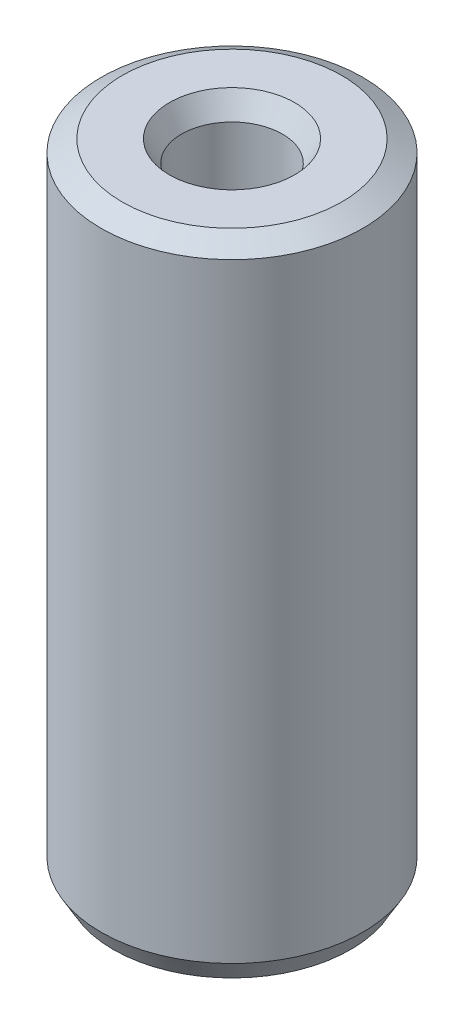
ISO-10303-21;
HEADER;
FILE_DESCRIPTION(('STEP AP214'),'2;1');
FILE_NAME('part.step','',(''),(''),'','','');
FILE_SCHEMA(('AUTOMOTIVE_DESIGN { 1 0 10303 214 1 1 1 1 }'));
ENDSEC;
DATA;
#1=APPLICATION_CONTEXT('core data for automotive mechanical design processes');
#2=APPLICATION_PROTOCOL_DEFINITION('international standard','automotive_design',2000,#1);
#3=PRODUCT_CONTEXT('',#1,'mechanical');
#4=PRODUCT('Part','Part','',(#3));
#5=PRODUCT_RELATED_PRODUCT_CATEGORY('part','',(#4));
#6=PRODUCT_DEFINITION_FORMATION('','',#4);
#7=PRODUCT_DEFINITION_CONTEXT('part definition',#1,'design');
#8=PRODUCT_DEFINITION('design','',#6,#7);
#9=PRODUCT_DEFINITION_SHAPE('','',#8);
#10=(LENGTH_UNIT() NAMED_UNIT(*) SI_UNIT(.MILLI.,.METRE.));
#11=(NAMED_UNIT(*) PLANE_ANGLE_UNIT() SI_UNIT($,.RADIAN.));
#12=(NAMED_UNIT(*) SI_UNIT($,.STERADIAN.) SOLID_ANGLE_UNIT());
#13=UNCERTAINTY_MEASURE_WITH_UNIT(LENGTH_MEASURE(1.E-05),#10,'distance_accuracy_value','');
#14=(GEOMETRIC_REPRESENTATION_CONTEXT(3) GLOBAL_UNCERTAINTY_ASSIGNED_CONTEXT((#13)) GLOBAL_UNIT_ASSIGNED_CONTEXT((#10,
#11,#12)) REPRESENTATION_CONTEXT('',''));
#15=CARTESIAN_POINT('',(0.,0.,0.));
#16=DIRECTION('',(0.,0.,1.));
#17=DIRECTION('',(1.,0.,0.));
#18=AXIS2_PLACEMENT_3D('',#15,#16,#17);
#19=CARTESIAN_POINT('',(0.,159.666058399962,0.));
#20=DIRECTION('',(0.,-1.,0.));
#21=DIRECTION('',(0.,0.,-1.));
#22=AXIS2_PLACEMENT_3D('',#19,#20,#21);
#23=CYLINDRICAL_SURFACE('',#22,32.5);
#24=CARTESIAN_POINT('',(0.,5.25552621330533,0.));
#25=DIRECTION('',(0.,1.,0.));
#26=DIRECTION('',(0.,0.,1.));
#27=AXIS2_PLACEMENT_3D('',#24,#25,#26);
#28=CIRCLE('',#27,32.5);
#29=CARTESIAN_POINT('',(0.,5.25552621330533,32.5));
#30=VERTEX_POINT('',#29);
#31=EDGE_CURVE('E10',#30,#30,#28,.T.);
#32=ORIENTED_EDGE('',*,*,#31,.T.);
#33=EDGE_LOOP('',(#32));
#34=FACE_BOUND('',#33,.T.);
#35=CARTESIAN_POINT('',(0.,156.631778925977,0.));
#36=DIRECTION('',(0.,1.,0.));
#37=DIRECTION('',(0.,0.,1.));
#38=AXIS2_PLACEMENT_3D('',#35,#36,#37);
#39=CIRCLE('',#38,32.5);
#40=CARTESIAN_POINT('',(0.,156.631778925977,32.5));
#41=VERTEX_POINT('',#40);
#42=EDGE_CURVE('E50',#41,#41,#39,.F.);
#43=ORIENTED_EDGE('',*,*,#42,.T.);
#44=EDGE_LOOP('',(#43));
#45=FACE_BOUND('',#44,.T.);
#46=ADVANCED_FACE('F39',(#34,#45),#23,.T.);
#47=CARTESIAN_POINT('',(0.,159.666058399962,0.));
#48=DIRECTION('',(0.,1.,0.));
#49=DIRECTION('',(0.,0.,1.));
#50=AXIS2_PLACEMENT_3D('',#47,#48,#49);
#51=PLANE('',#50);
#52=CARTESIAN_POINT('',(0.,159.666058399962,0.));
#53=DIRECTION('',(0.,1.,0.));
#54=DIRECTION('',(0.,0.,1.));
#55=AXIS2_PLACEMENT_3D('',#52,#53,#54);
#56=CIRCLE('',#55,15.5607626645507);
#57=CARTESIAN_POINT('',(0.,159.666058399962,15.5607626645507));
#58=VERTEX_POINT('',#57);
#59=EDGE_CURVE('E58',#58,#58,#56,.F.);
#60=ORIENTED_EDGE('',*,*,#59,.T.);
#61=EDGE_LOOP('',(#60));
#62=FACE_BOUND('',#61,.T.);
#63=CARTESIAN_POINT('',(0.,159.666058399962,0.));
#64=DIRECTION('',(0.,1.,0.));
#65=DIRECTION('',(0.,0.,1.));
#66=AXIS2_PLACEMENT_3D('',#63,#64,#65);
#67=CIRCLE('',#66,27.2444737866946);
#68=CARTESIAN_POINT('',(0.,159.666058399962,27.2444737866946));
#69=VERTEX_POINT('',#68);
#70=EDGE_CURVE('E61',#69,#69,#67,.T.);
#71=ORIENTED_EDGE('',*,*,#70,.T.);
#72=EDGE_LOOP('',(#71));
#73=FACE_BOUND('',#72,.T.);
#74=ADVANCED_FACE('F88',(#62,#73),#51,.T.);
#75=CARTESIAN_POINT('',(0.,0.,0.));
#76=DIRECTION('',(0.,1.,0.));
#77=DIRECTION('',(0.,0.,1.));
#78=AXIS2_PLACEMENT_3D('',#75,#76,#77);
#79=PLANE('',#78);
#80=CARTESIAN_POINT('',(0.,0.,0.));
#81=DIRECTION('',(0.,1.,0.));
#82=DIRECTION('',(0.,0.,1.));
#83=AXIS2_PLACEMENT_3D('',#80,#81,#82);
#84=CIRCLE('',#83,17.7820094038711);
#85=CARTESIAN_POINT('',(0.,0.,17.7820094038711));
#86=VERTEX_POINT('',#85);
#87=EDGE_CURVE('E51',#86,#86,#84,.T.);
#88=ORIENTED_EDGE('',*,*,#87,.T.);
#89=EDGE_LOOP('',(#88));
#90=FACE_BOUND('',#89,.T.);
#91=CARTESIAN_POINT('',(0.,0.,0.));
#92=DIRECTION('',(0.,1.,0.));
#93=DIRECTION('',(0.,0.,1.));
#94=AXIS2_PLACEMENT_3D('',#91,#92,#93);
#95=CIRCLE('',#94,29.465720526015);
#96=CARTESIAN_POINT('',(0.,0.,29.465720526015));
#97=VERTEX_POINT('',#96);
#98=EDGE_CURVE('E54',#97,#97,#95,.F.);
#99=ORIENTED_EDGE('',*,*,#98,.T.);
#100=EDGE_LOOP('',(#99));
#101=FACE_BOUND('',#100,.T.);
#102=ADVANCED_FACE('F83',(#90,#101),#79,.F.);
#103=CARTESIAN_POINT('',(0.,159.666058399962,0.));
#104=DIRECTION('',(0.,-1.,0.));
#105=DIRECTION('',(0.,0.,-1.));
#106=AXIS2_PLACEMENT_3D('',#103,#104,#105);
#107=CYLINDRICAL_SURFACE('',#106,12.5264831905657);
#108=CARTESIAN_POINT('',(0.,154.410532186656,0.));
#109=DIRECTION('',(0.,1.,0.));
#110=DIRECTION('',(0.,0.,1.));
#111=AXIS2_PLACEMENT_3D('',#108,#109,#110);
#112=CIRCLE('',#111,12.5264831905657);
#113=CARTESIAN_POINT('',(0.,154.410532186656,12.5264831905657));
#114=VERTEX_POINT('',#113);
#115=EDGE_CURVE('E67',#114,#114,#112,.T.);
#116=ORIENTED_EDGE('',*,*,#115,.T.);
#117=EDGE_LOOP('',(#116));
#118=FACE_BOUND('',#117,.T.);
#119=CARTESIAN_POINT('',(0.,3.03427947398502,0.));
#120=DIRECTION('',(0.,1.,0.));
#121=DIRECTION('',(0.,0.,1.));
#122=AXIS2_PLACEMENT_3D('',#119,#120,#121);
#123=CIRCLE('',#122,12.5264831905657);
#124=CARTESIAN_POINT('',(0.,3.03427947398502,12.5264831905657));
#125=VERTEX_POINT('',#124);
#126=EDGE_CURVE('E69',#125,#125,#123,.F.);
#127=ORIENTED_EDGE('',*,*,#126,.T.);
#128=EDGE_LOOP('',(#127));
#129=FACE_BOUND('',#128,.T.);
#130=ADVANCED_FACE('F71',(#118,#129),#107,.F.);
#131=CARTESIAN_POINT('',(0.,154.410532186656,0.));
#132=DIRECTION('',(0.,1.,0.));
#133=DIRECTION('',(0.,0.,1.));
#134=AXIS2_PLACEMENT_3D('',#131,#132,#133);
#135=CONICAL_SURFACE('',#134,12.5264831905657,0.523598775598301);
#136=ORIENTED_EDGE('',*,*,#59,.F.);
#137=EDGE_LOOP('',(#136));
#138=FACE_BOUND('',#137,.T.);
#139=ORIENTED_EDGE('',*,*,#115,.F.);
#140=EDGE_LOOP('',(#139));
#141=FACE_BOUND('',#140,.T.);
#142=ADVANCED_FACE('F77',(#138,#141),#135,.F.);
#143=CARTESIAN_POINT('',(0.,0.,0.));
#144=DIRECTION('',(0.,-1.,0.));
#145=DIRECTION('',(0.,0.,-1.));
#146=AXIS2_PLACEMENT_3D('',#143,#144,#145);
#147=CONICAL_SURFACE('',#146,17.7820094038711,1.04719755119659);
#148=ORIENTED_EDGE('',*,*,#126,.F.);
#149=EDGE_LOOP('',(#148));
#150=FACE_BOUND('',#149,.T.);
#151=ORIENTED_EDGE('',*,*,#87,.F.);
#152=EDGE_LOOP('',(#151));
#153=FACE_BOUND('',#152,.T.);
#154=ADVANCED_FACE('F73',(#150,#153),#147,.F.);
#155=CARTESIAN_POINT('',(0.,5.25552621330533,0.));
#156=DIRECTION('',(0.,1.,0.));
#157=DIRECTION('',(0.,0.,1.));
#158=AXIS2_PLACEMENT_3D('',#155,#156,#157);
#159=CONICAL_SURFACE('',#158,32.5,0.523598775598304);
#160=ORIENTED_EDGE('',*,*,#98,.F.);
#161=EDGE_LOOP('',(#160));
#162=FACE_BOUND('',#161,.T.);
#163=ORIENTED_EDGE('',*,*,#31,.F.);
#164=EDGE_LOOP('',(#163));
#165=FACE_BOUND('',#164,.T.);
#166=ADVANCED_FACE('F76',(#162,#165),#159,.T.);
#167=CARTESIAN_POINT('',(0.,159.666058399962,0.));
#168=DIRECTION('',(0.,-1.,0.));
#169=DIRECTION('',(0.,0.,-1.));
#170=AXIS2_PLACEMENT_3D('',#167,#168,#169);
#171=CONICAL_SURFACE('',#170,27.2444737866946,1.04719755119659);
#172=ORIENTED_EDGE('',*,*,#42,.F.);
#173=EDGE_LOOP('',(#172));
#174=FACE_BOUND('',#173,.T.);
#175=ORIENTED_EDGE('',*,*,#70,.F.);
#176=EDGE_LOOP('',(#175));
#177=FACE_BOUND('',#176,.T.);
#178=ADVANCED_FACE('F45',(#174,#177),#171,.T.);
#179=CLOSED_SHELL('',(#46,#74,#102,#130,#142,#154,#166,#178));
#180=MANIFOLD_SOLID_BREP('B2',#179);
#181=ADVANCED_BREP_SHAPE_REPRESENTATION('',(#18,#180),#14);
#182=SHAPE_DEFINITION_REPRESENTATION(#9,#181);
ENDSEC;
END-ISO-10303-21;
